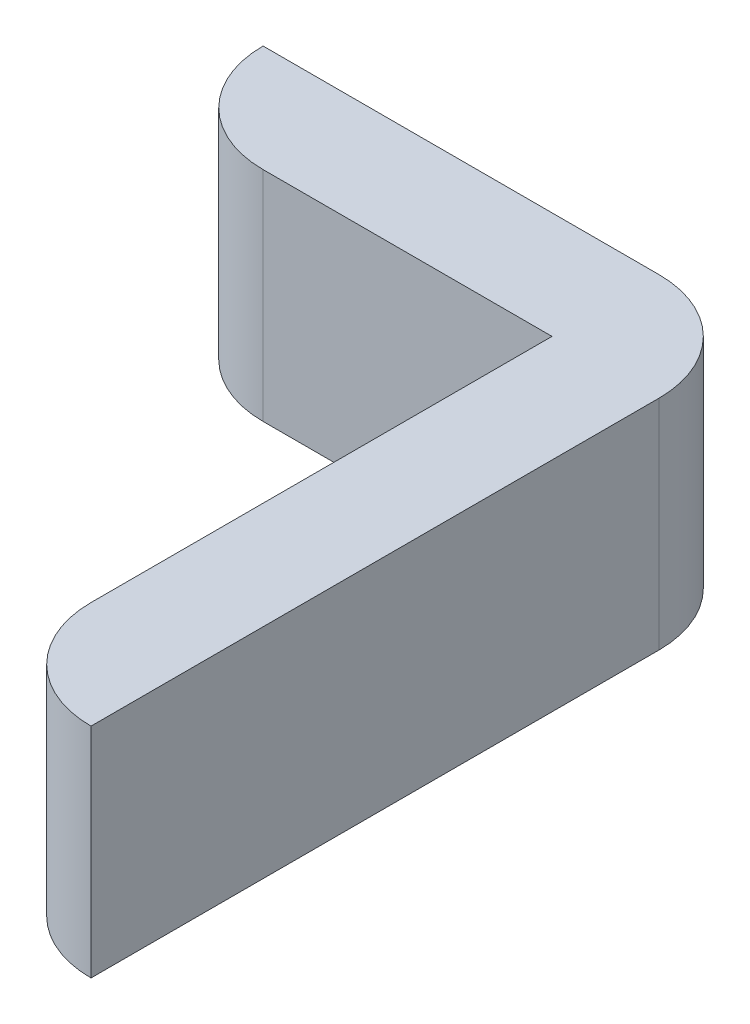
ISO-10303-21;
HEADER;
FILE_DESCRIPTION(('STEP AP214'),'2;1');
FILE_NAME('part.step','',(''),(''),'','','');
FILE_SCHEMA(('AUTOMOTIVE_DESIGN { 1 0 10303 214 1 1 1 1 }'));
ENDSEC;
DATA;
#1=APPLICATION_CONTEXT('core data for automotive mechanical design processes');
#2=APPLICATION_PROTOCOL_DEFINITION('international standard','automotive_design',2000,#1);
#3=PRODUCT_CONTEXT('',#1,'mechanical');
#4=PRODUCT('Part','Part','',(#3));
#5=PRODUCT_RELATED_PRODUCT_CATEGORY('part','',(#4));
#6=PRODUCT_DEFINITION_FORMATION('','',#4);
#7=PRODUCT_DEFINITION_CONTEXT('part definition',#1,'design');
#8=PRODUCT_DEFINITION('design','',#6,#7);
#9=PRODUCT_DEFINITION_SHAPE('','',#8);
#10=(LENGTH_UNIT() NAMED_UNIT(*) SI_UNIT(.MILLI.,.METRE.));
#11=(NAMED_UNIT(*) PLANE_ANGLE_UNIT() SI_UNIT($,.RADIAN.));
#12=(NAMED_UNIT(*) SI_UNIT($,.STERADIAN.) SOLID_ANGLE_UNIT());
#13=UNCERTAINTY_MEASURE_WITH_UNIT(LENGTH_MEASURE(1.E-05),#10,'distance_accuracy_value','');
#14=(GEOMETRIC_REPRESENTATION_CONTEXT(3) GLOBAL_UNCERTAINTY_ASSIGNED_CONTEXT((#13)) GLOBAL_UNIT_ASSIGNED_CONTEXT((#10,
#11,#12)) REPRESENTATION_CONTEXT('',''));
#15=CARTESIAN_POINT('',(0.,0.,0.));
#16=DIRECTION('',(0.,0.,1.));
#17=DIRECTION('',(1.,0.,0.));
#18=AXIS2_PLACEMENT_3D('',#15,#16,#17);
#19=CARTESIAN_POINT('',(-0.125,-4.8252,0.));
#20=DIRECTION('',(0.,-1.,0.));
#21=DIRECTION('',(0.,0.,-1.));
#22=AXIS2_PLACEMENT_3D('',#19,#20,#21);
#23=PLANE('',#22);
#24=DIRECTION('',(-1.,0.,0.));
#25=VECTOR('',#24,1.);
#26=CARTESIAN_POINT('',(0.125,-4.8252,0.25));
#27=LINE('',#26,#25);
#28=CARTESIAN_POINT('',(0.125,-4.8252,0.25));
#29=VERTEX_POINT('',#28);
#30=CARTESIAN_POINT('',(0.8,-4.8252,0.25));
#31=VERTEX_POINT('',#30);
#32=EDGE_CURVE('E102',#29,#31,#27,.F.);
#33=ORIENTED_EDGE('',*,*,#32,.T.);
#34=DIRECTION('',(0.,0.,-1.));
#35=VECTOR('',#34,1.);
#36=CARTESIAN_POINT('',(0.8,-4.8252,0.25));
#37=LINE('',#36,#35);
#38=CARTESIAN_POINT('',(0.8,-4.8252,1.327));
#39=VERTEX_POINT('',#38);
#40=EDGE_CURVE('E108',#31,#39,#37,.F.);
#41=ORIENTED_EDGE('',*,*,#40,.T.);
#42=CARTESIAN_POINT('',(1.05,-4.8252,1.327));
#43=DIRECTION('',(0.,-1.,0.));
#44=DIRECTION('',(0.,0.,-1.));
#45=AXIS2_PLACEMENT_3D('',#42,#43,#44);
#46=CIRCLE('',#45,0.25);
#47=CARTESIAN_POINT('',(1.05,-4.8252,1.577));
#48=VERTEX_POINT('',#47);
#49=EDGE_CURVE('E80',#48,#39,#46,.T.);
#50=ORIENTED_EDGE('',*,*,#49,.F.);
#51=DIRECTION('',(0.,0.,1.));
#52=VECTOR('',#51,1.);
#53=CARTESIAN_POINT('',(1.05,-4.8252,1.577));
#54=LINE('',#53,#52);
#55=CARTESIAN_POINT('',(1.05,-4.8252,0.25));
#56=VERTEX_POINT('',#55);
#57=EDGE_CURVE('E75',#48,#56,#54,.F.);
#58=ORIENTED_EDGE('',*,*,#57,.T.);
#59=CARTESIAN_POINT('',(0.8,-4.8252,0.25));
#60=DIRECTION('',(0.,-1.,0.));
#61=DIRECTION('',(0.,0.,-1.));
#62=AXIS2_PLACEMENT_3D('',#59,#60,#61);
#63=CIRCLE('',#62,0.25);
#64=CARTESIAN_POINT('',(0.8,-4.8252,0.));
#65=VERTEX_POINT('',#64);
#66=EDGE_CURVE('E19',#65,#56,#63,.T.);
#67=ORIENTED_EDGE('',*,*,#66,.F.);
#68=DIRECTION('',(1.,0.,0.));
#69=VECTOR('',#68,1.);
#70=CARTESIAN_POINT('',(0.8,-4.8252,0.));
#71=LINE('',#70,#69);
#72=CARTESIAN_POINT('',(-0.125,-4.8252,0.));
#73=VERTEX_POINT('',#72);
#74=EDGE_CURVE('E70',#65,#73,#71,.F.);
#75=ORIENTED_EDGE('',*,*,#74,.T.);
#76=CARTESIAN_POINT('',(0.125,-4.8252,0.));
#77=DIRECTION('',(0.,-1.,0.));
#78=DIRECTION('',(0.,0.,-1.));
#79=AXIS2_PLACEMENT_3D('',#76,#77,#78);
#80=CIRCLE('',#79,0.25);
#81=EDGE_CURVE('E121',#29,#73,#80,.T.);
#82=ORIENTED_EDGE('',*,*,#81,.F.);
#83=EDGE_LOOP('',(#33,#41,#50,#58,#67,#75,#82));
#84=FACE_BOUND('',#83,.T.);
#85=ADVANCED_FACE('F16',(#84),#23,.F.);
#86=CARTESIAN_POINT('',(0.8,-5.3348,0.));
#87=DIRECTION('',(0.,0.,1.));
#88=DIRECTION('',(1.,0.,0.));
#89=AXIS2_PLACEMENT_3D('',#86,#87,#88);
#90=PLANE('',#89);
#91=DIRECTION('',(0.,-1.,0.));
#92=VECTOR('',#91,1.);
#93=CARTESIAN_POINT('',(-0.125,-5.3348,0.));
#94=LINE('',#93,#92);
#95=CARTESIAN_POINT('',(-0.125,-5.3348,0.));
#96=VERTEX_POINT('',#95);
#97=EDGE_CURVE('E123',#73,#96,#94,.T.);
#98=ORIENTED_EDGE('',*,*,#97,.F.);
#99=ORIENTED_EDGE('',*,*,#74,.F.);
#100=DIRECTION('',(0.,-1.,0.));
#101=VECTOR('',#100,1.);
#102=CARTESIAN_POINT('',(0.8,-5.3348,0.));
#103=LINE('',#102,#101);
#104=CARTESIAN_POINT('',(0.8,-5.3348,0.));
#105=VERTEX_POINT('',#104);
#106=EDGE_CURVE('E92',#105,#65,#103,.F.);
#107=ORIENTED_EDGE('',*,*,#106,.F.);
#108=DIRECTION('',(1.,0.,0.));
#109=VECTOR('',#108,1.);
#110=CARTESIAN_POINT('',(-0.125,-5.3348,0.));
#111=LINE('',#110,#109);
#112=EDGE_CURVE('E120',#96,#105,#111,.T.);
#113=ORIENTED_EDGE('',*,*,#112,.F.);
#114=EDGE_LOOP('',(#98,#99,#107,#113));
#115=FACE_BOUND('',#114,.T.);
#116=ADVANCED_FACE('F158',(#115),#90,.F.);
#117=CARTESIAN_POINT('',(0.8,-5.3348,0.25));
#118=DIRECTION('',(0.,-1.,0.));
#119=DIRECTION('',(0.,0.,-1.));
#120=AXIS2_PLACEMENT_3D('',#117,#118,#119);
#121=CYLINDRICAL_SURFACE('',#120,0.25);
#122=ORIENTED_EDGE('',*,*,#66,.T.);
#123=DIRECTION('',(0.,1.,0.));
#124=VECTOR('',#123,1.);
#125=CARTESIAN_POINT('',(1.05,-5.3348,0.25));
#126=LINE('',#125,#124);
#127=CARTESIAN_POINT('',(1.05,-5.3348,0.25));
#128=VERTEX_POINT('',#127);
#129=EDGE_CURVE('E86',#56,#128,#126,.F.);
#130=ORIENTED_EDGE('',*,*,#129,.T.);
#131=CARTESIAN_POINT('',(0.8,-5.3348,0.25));
#132=DIRECTION('',(0.,-1.,0.));
#133=DIRECTION('',(0.,0.,-1.));
#134=AXIS2_PLACEMENT_3D('',#131,#132,#133);
#135=CIRCLE('',#134,0.25);
#136=EDGE_CURVE('E118',#105,#128,#135,.T.);
#137=ORIENTED_EDGE('',*,*,#136,.F.);
#138=ORIENTED_EDGE('',*,*,#106,.T.);
#139=EDGE_LOOP('',(#122,#130,#137,#138));
#140=FACE_BOUND('',#139,.T.);
#141=ADVANCED_FACE('F89',(#140),#121,.T.);
#142=CARTESIAN_POINT('',(1.05,-5.3348,1.577));
#143=DIRECTION('',(-1.,0.,0.));
#144=DIRECTION('',(0.,0.,1.));
#145=AXIS2_PLACEMENT_3D('',#142,#143,#144);
#146=PLANE('',#145);
#147=DIRECTION('',(0.,-1.,0.));
#148=VECTOR('',#147,1.);
#149=CARTESIAN_POINT('',(1.05,-5.3348,1.577));
#150=LINE('',#149,#148);
#151=CARTESIAN_POINT('',(1.05,-5.3348,1.577));
#152=VERTEX_POINT('',#151);
#153=EDGE_CURVE('E85',#152,#48,#150,.F.);
#154=ORIENTED_EDGE('',*,*,#153,.F.);
#155=DIRECTION('',(0.,0.,-1.));
#156=VECTOR('',#155,1.);
#157=CARTESIAN_POINT('',(1.05,-5.3348,0.));
#158=LINE('',#157,#156);
#159=EDGE_CURVE('E94',#128,#152,#158,.F.);
#160=ORIENTED_EDGE('',*,*,#159,.F.);
#161=ORIENTED_EDGE('',*,*,#129,.F.);
#162=ORIENTED_EDGE('',*,*,#57,.F.);
#163=EDGE_LOOP('',(#154,#160,#161,#162));
#164=FACE_BOUND('',#163,.T.);
#165=ADVANCED_FACE('F93',(#164),#146,.F.);
#166=CARTESIAN_POINT('',(1.05,-5.3348,1.327));
#167=DIRECTION('',(0.,-1.,0.));
#168=DIRECTION('',(0.,0.,-1.));
#169=AXIS2_PLACEMENT_3D('',#166,#167,#168);
#170=CYLINDRICAL_SURFACE('',#169,0.25);
#171=ORIENTED_EDGE('',*,*,#49,.T.);
#172=DIRECTION('',(0.,1.,0.));
#173=VECTOR('',#172,1.);
#174=CARTESIAN_POINT('',(0.8,-5.3348,1.327));
#175=LINE('',#174,#173);
#176=CARTESIAN_POINT('',(0.8,-5.3348,1.327));
#177=VERTEX_POINT('',#176);
#178=EDGE_CURVE('E105',#39,#177,#175,.F.);
#179=ORIENTED_EDGE('',*,*,#178,.T.);
#180=CARTESIAN_POINT('',(1.05,-5.3348,1.327));
#181=DIRECTION('',(0.,-1.,0.));
#182=DIRECTION('',(0.,0.,-1.));
#183=AXIS2_PLACEMENT_3D('',#180,#181,#182);
#184=CIRCLE('',#183,0.25);
#185=EDGE_CURVE('E114',#152,#177,#184,.T.);
#186=ORIENTED_EDGE('',*,*,#185,.F.);
#187=ORIENTED_EDGE('',*,*,#153,.T.);
#188=EDGE_LOOP('',(#171,#179,#186,#187));
#189=FACE_BOUND('',#188,.T.);
#190=ADVANCED_FACE('F127',(#189),#170,.T.);
#191=CARTESIAN_POINT('',(0.8,-5.3348,0.25));
#192=DIRECTION('',(1.,0.,0.));
#193=DIRECTION('',(0.,0.,-1.));
#194=AXIS2_PLACEMENT_3D('',#191,#192,#193);
#195=PLANE('',#194);
#196=ORIENTED_EDGE('',*,*,#178,.F.);
#197=ORIENTED_EDGE('',*,*,#40,.F.);
#198=DIRECTION('',(0.,1.,0.));
#199=VECTOR('',#198,1.);
#200=CARTESIAN_POINT('',(0.8,-5.3348,0.25));
#201=LINE('',#200,#199);
#202=CARTESIAN_POINT('',(0.8,-5.3348,0.25));
#203=VERTEX_POINT('',#202);
#204=EDGE_CURVE('E104',#31,#203,#201,.F.);
#205=ORIENTED_EDGE('',*,*,#204,.T.);
#206=DIRECTION('',(0.,0.,-1.));
#207=VECTOR('',#206,1.);
#208=CARTESIAN_POINT('',(0.8,-5.3348,0.));
#209=LINE('',#208,#207);
#210=EDGE_CURVE('E117',#177,#203,#209,.T.);
#211=ORIENTED_EDGE('',*,*,#210,.F.);
#212=EDGE_LOOP('',(#196,#197,#205,#211));
#213=FACE_BOUND('',#212,.T.);
#214=ADVANCED_FACE('F150',(#213),#195,.F.);
#215=CARTESIAN_POINT('',(0.125,-5.3348,0.25));
#216=DIRECTION('',(0.,0.,-1.));
#217=DIRECTION('',(-1.,0.,0.));
#218=AXIS2_PLACEMENT_3D('',#215,#216,#217);
#219=PLANE('',#218);
#220=ORIENTED_EDGE('',*,*,#204,.F.);
#221=ORIENTED_EDGE('',*,*,#32,.F.);
#222=DIRECTION('',(0.,-1.,0.));
#223=VECTOR('',#222,1.);
#224=CARTESIAN_POINT('',(0.125,-5.3348,0.25));
#225=LINE('',#224,#223);
#226=CARTESIAN_POINT('',(0.125,-5.3348,0.25));
#227=VERTEX_POINT('',#226);
#228=EDGE_CURVE('E34',#227,#29,#225,.F.);
#229=ORIENTED_EDGE('',*,*,#228,.F.);
#230=DIRECTION('',(1.,0.,0.));
#231=VECTOR('',#230,1.);
#232=CARTESIAN_POINT('',(-0.125,-5.3348,0.25));
#233=LINE('',#232,#231);
#234=EDGE_CURVE('E25',#203,#227,#233,.F.);
#235=ORIENTED_EDGE('',*,*,#234,.F.);
#236=EDGE_LOOP('',(#220,#221,#229,#235));
#237=FACE_BOUND('',#236,.T.);
#238=ADVANCED_FACE('F151',(#237),#219,.F.);
#239=CARTESIAN_POINT('',(0.125,-5.3348,0.));
#240=DIRECTION('',(0.,-1.,0.));
#241=DIRECTION('',(0.,0.,-1.));
#242=AXIS2_PLACEMENT_3D('',#239,#240,#241);
#243=CYLINDRICAL_SURFACE('',#242,0.25);
#244=ORIENTED_EDGE('',*,*,#81,.T.);
#245=ORIENTED_EDGE('',*,*,#97,.T.);
#246=CARTESIAN_POINT('',(0.125,-5.3348,0.));
#247=DIRECTION('',(0.,-1.,0.));
#248=DIRECTION('',(0.,0.,-1.));
#249=AXIS2_PLACEMENT_3D('',#246,#247,#248);
#250=CIRCLE('',#249,0.25);
#251=EDGE_CURVE('E11',#227,#96,#250,.T.);
#252=ORIENTED_EDGE('',*,*,#251,.F.);
#253=ORIENTED_EDGE('',*,*,#228,.T.);
#254=EDGE_LOOP('',(#244,#245,#252,#253));
#255=FACE_BOUND('',#254,.T.);
#256=ADVANCED_FACE('F156',(#255),#243,.T.);
#257=CARTESIAN_POINT('',(-0.125,-5.3348,0.));
#258=DIRECTION('',(0.,-1.,0.));
#259=DIRECTION('',(0.,0.,-1.));
#260=AXIS2_PLACEMENT_3D('',#257,#258,#259);
#261=PLANE('',#260);
#262=ORIENTED_EDGE('',*,*,#234,.T.);
#263=ORIENTED_EDGE('',*,*,#251,.T.);
#264=ORIENTED_EDGE('',*,*,#112,.T.);
#265=ORIENTED_EDGE('',*,*,#136,.T.);
#266=ORIENTED_EDGE('',*,*,#159,.T.);
#267=ORIENTED_EDGE('',*,*,#185,.T.);
#268=ORIENTED_EDGE('',*,*,#210,.T.);
#269=EDGE_LOOP('',(#262,#263,#264,#265,#266,#267,#268));
#270=FACE_BOUND('',#269,.T.);
#271=ADVANCED_FACE('F132',(#270),#261,.T.);
#272=CLOSED_SHELL('',(#85,#116,#141,#165,#190,#214,#238,#256,#271));
#273=MANIFOLD_SOLID_BREP('B1',#272);
#274=ADVANCED_BREP_SHAPE_REPRESENTATION('',(#18,#273),#14);
#275=SHAPE_DEFINITION_REPRESENTATION(#9,#274);
ENDSEC;
END-ISO-10303-21;
